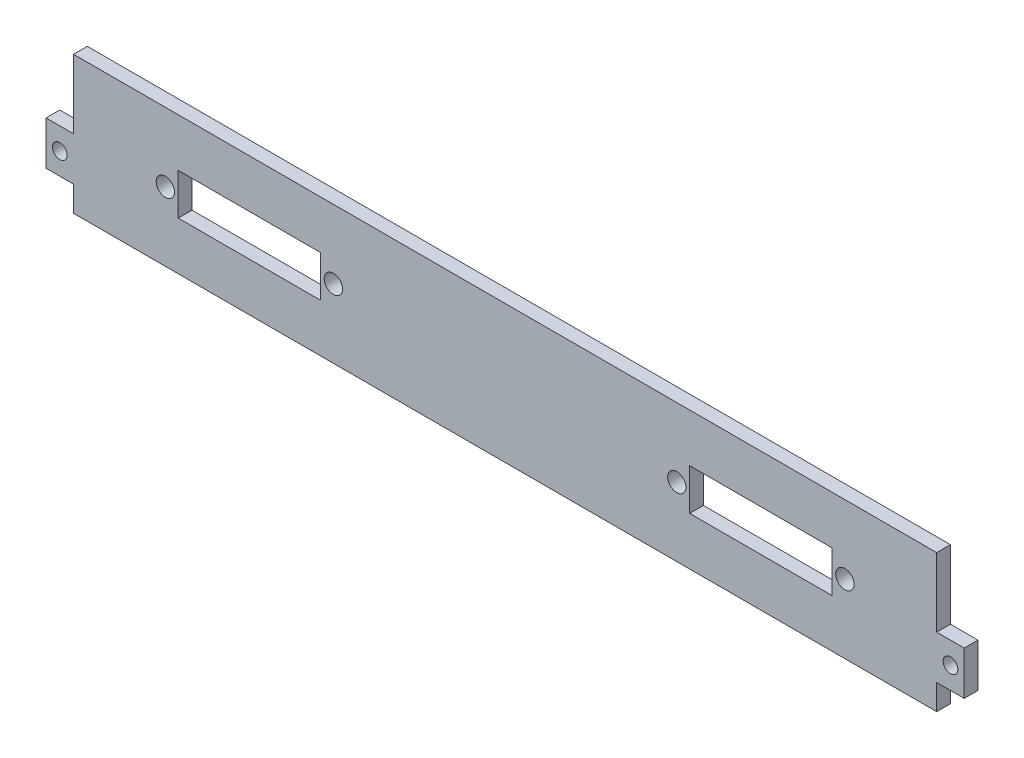
ISO-10303-21;
HEADER;
FILE_DESCRIPTION(('STEP AP214'),'2;1');
FILE_NAME('part.step','',(''),(''),'','','');
FILE_SCHEMA(('AUTOMOTIVE_DESIGN { 1 0 10303 214 1 1 1 1 }'));
ENDSEC;
DATA;
#1=APPLICATION_CONTEXT('core data for automotive mechanical design processes');
#2=APPLICATION_PROTOCOL_DEFINITION('international standard','automotive_design',2000,#1);
#3=PRODUCT_CONTEXT('',#1,'mechanical');
#4=PRODUCT('Part','Part','',(#3));
#5=PRODUCT_RELATED_PRODUCT_CATEGORY('part','',(#4));
#6=PRODUCT_DEFINITION_FORMATION('','',#4);
#7=PRODUCT_DEFINITION_CONTEXT('part definition',#1,'design');
#8=PRODUCT_DEFINITION('design','',#6,#7);
#9=PRODUCT_DEFINITION_SHAPE('','',#8);
#10=(LENGTH_UNIT() NAMED_UNIT(*) SI_UNIT(.MILLI.,.METRE.));
#11=(NAMED_UNIT(*) PLANE_ANGLE_UNIT() SI_UNIT($,.RADIAN.));
#12=(NAMED_UNIT(*) SI_UNIT($,.STERADIAN.) SOLID_ANGLE_UNIT());
#13=UNCERTAINTY_MEASURE_WITH_UNIT(LENGTH_MEASURE(1.E-05),#10,'distance_accuracy_value','');
#14=(GEOMETRIC_REPRESENTATION_CONTEXT(3) GLOBAL_UNCERTAINTY_ASSIGNED_CONTEXT((#13)) GLOBAL_UNIT_ASSIGNED_CONTEXT((#10,
#11,#12)) REPRESENTATION_CONTEXT('',''));
#15=CARTESIAN_POINT('',(0.,0.,0.));
#16=DIRECTION('',(0.,0.,1.));
#17=DIRECTION('',(1.,0.,0.));
#18=AXIS2_PLACEMENT_3D('',#15,#16,#17);
#19=CARTESIAN_POINT('',(0.,0.,3.));
#20=DIRECTION('',(0.,0.,1.));
#21=DIRECTION('',(1.,0.,0.));
#22=AXIS2_PLACEMENT_3D('',#19,#20,#21);
#23=PLANE('',#22);
#24=CARTESIAN_POINT('',(37.4,0.,3.));
#25=DIRECTION('',(0.,0.,1.));
#26=DIRECTION('',(-1.,0.,0.));
#27=AXIS2_PLACEMENT_3D('',#24,#25,#26);
#28=CIRCLE('',#27,2.);
#29=CARTESIAN_POINT('',(35.4,0.,3.));
#30=VERTEX_POINT('',#29);
#31=EDGE_CURVE('E245',#30,#30,#28,.T.);
#32=ORIENTED_EDGE('',*,*,#31,.F.);
#33=EDGE_LOOP('',(#32));
#34=FACE_BOUND('',#33,.T.);
#35=CARTESIAN_POINT('',(-74.,0.,3.));
#36=DIRECTION('',(0.,0.,1.));
#37=DIRECTION('',(1.,0.,0.));
#38=AXIS2_PLACEMENT_3D('',#35,#36,#37);
#39=CIRCLE('',#38,2.);
#40=CARTESIAN_POINT('',(-72.,0.,3.));
#41=VERTEX_POINT('',#40);
#42=EDGE_CURVE('E257',#41,#41,#39,.T.);
#43=ORIENTED_EDGE('',*,*,#42,.F.);
#44=EDGE_LOOP('',(#43));
#45=FACE_BOUND('',#44,.T.);
#46=CARTESIAN_POINT('',(-97.,-4.75000000000001,3.));
#47=DIRECTION('',(0.,0.,1.));
#48=DIRECTION('',(1.,0.,0.));
#49=AXIS2_PLACEMENT_3D('',#46,#47,#48);
#50=CIRCLE('',#49,1.60000000000001);
#51=CARTESIAN_POINT('',(-95.4,-4.75000000000001,3.));
#52=VERTEX_POINT('',#51);
#53=EDGE_CURVE('E269',#52,#52,#50,.T.);
#54=ORIENTED_EDGE('',*,*,#53,.F.);
#55=EDGE_LOOP('',(#54));
#56=FACE_BOUND('',#55,.T.);
#57=DIRECTION('',(0.,1.,0.));
#58=VECTOR('',#57,1.);
#59=CARTESIAN_POINT('',(94.,-9.49999999999999,3.));
#60=LINE('',#59,#58);
#61=CARTESIAN_POINT('',(94.,-15.,3.));
#62=VERTEX_POINT('',#61);
#63=CARTESIAN_POINT('',(94.,-9.49999999999999,3.));
#64=VERTEX_POINT('',#63);
#65=EDGE_CURVE('E275',#62,#64,#60,.T.);
#66=ORIENTED_EDGE('',*,*,#65,.T.);
#67=DIRECTION('',(1.,0.,0.));
#68=VECTOR('',#67,1.);
#69=CARTESIAN_POINT('',(94.,-9.49999999999999,3.));
#70=LINE('',#69,#68);
#71=CARTESIAN_POINT('',(100.,-9.49999999999998,3.));
#72=VERTEX_POINT('',#71);
#73=EDGE_CURVE('E278',#64,#72,#70,.T.);
#74=ORIENTED_EDGE('',*,*,#73,.T.);
#75=DIRECTION('',(0.,1.,0.));
#76=VECTOR('',#75,1.);
#77=CARTESIAN_POINT('',(100.,0.,3.));
#78=LINE('',#77,#76);
#79=CARTESIAN_POINT('',(100.,0.,3.));
#80=VERTEX_POINT('',#79);
#81=EDGE_CURVE('E281',#72,#80,#78,.T.);
#82=ORIENTED_EDGE('',*,*,#81,.T.);
#83=DIRECTION('',(-1.,0.,0.));
#84=VECTOR('',#83,1.);
#85=CARTESIAN_POINT('',(94.,0.,3.));
#86=LINE('',#85,#84);
#87=CARTESIAN_POINT('',(94.,0.,3.));
#88=VERTEX_POINT('',#87);
#89=EDGE_CURVE('E283',#80,#88,#86,.T.);
#90=ORIENTED_EDGE('',*,*,#89,.T.);
#91=DIRECTION('',(0.,1.,0.));
#92=VECTOR('',#91,1.);
#93=CARTESIAN_POINT('',(94.,15.,3.));
#94=LINE('',#93,#92);
#95=CARTESIAN_POINT('',(94.,15.,3.));
#96=VERTEX_POINT('',#95);
#97=EDGE_CURVE('E285',#88,#96,#94,.T.);
#98=ORIENTED_EDGE('',*,*,#97,.T.);
#99=DIRECTION('',(-1.,0.,0.));
#100=VECTOR('',#99,1.);
#101=CARTESIAN_POINT('',(-94.,15.,3.));
#102=LINE('',#101,#100);
#103=CARTESIAN_POINT('',(-94.,15.,3.));
#104=VERTEX_POINT('',#103);
#105=EDGE_CURVE('E287',#96,#104,#102,.T.);
#106=ORIENTED_EDGE('',*,*,#105,.T.);
#107=DIRECTION('',(0.,-1.,0.));
#108=VECTOR('',#107,1.);
#109=CARTESIAN_POINT('',(-94.,15.,3.));
#110=LINE('',#109,#108);
#111=CARTESIAN_POINT('',(-94.,0.,3.));
#112=VERTEX_POINT('',#111);
#113=EDGE_CURVE('E289',#104,#112,#110,.T.);
#114=ORIENTED_EDGE('',*,*,#113,.T.);
#115=DIRECTION('',(-1.,0.,0.));
#116=VECTOR('',#115,1.);
#117=CARTESIAN_POINT('',(-94.,0.,3.));
#118=LINE('',#117,#116);
#119=CARTESIAN_POINT('',(-100.,0.,3.));
#120=VERTEX_POINT('',#119);
#121=EDGE_CURVE('E291',#112,#120,#118,.T.);
#122=ORIENTED_EDGE('',*,*,#121,.T.);
#123=DIRECTION('',(0.,-1.,0.));
#124=VECTOR('',#123,1.);
#125=CARTESIAN_POINT('',(-100.,0.,3.));
#126=LINE('',#125,#124);
#127=CARTESIAN_POINT('',(-100.,-9.50000000000001,3.));
#128=VERTEX_POINT('',#127);
#129=EDGE_CURVE('E293',#120,#128,#126,.T.);
#130=ORIENTED_EDGE('',*,*,#129,.T.);
#131=DIRECTION('',(1.,0.,0.));
#132=VECTOR('',#131,1.);
#133=CARTESIAN_POINT('',(-94.,-9.50000000000001,3.));
#134=LINE('',#133,#132);
#135=CARTESIAN_POINT('',(-94.,-9.50000000000001,3.));
#136=VERTEX_POINT('',#135);
#137=EDGE_CURVE('E295',#128,#136,#134,.T.);
#138=ORIENTED_EDGE('',*,*,#137,.T.);
#139=DIRECTION('',(0.,-1.,0.));
#140=VECTOR('',#139,1.);
#141=CARTESIAN_POINT('',(-94.,-9.50000000000001,3.));
#142=LINE('',#141,#140);
#143=CARTESIAN_POINT('',(-94.,-15.,3.));
#144=VERTEX_POINT('',#143);
#145=EDGE_CURVE('E297',#136,#144,#142,.T.);
#146=ORIENTED_EDGE('',*,*,#145,.T.);
#147=DIRECTION('',(1.,0.,0.));
#148=VECTOR('',#147,1.);
#149=CARTESIAN_POINT('',(-94.,-15.,3.));
#150=LINE('',#149,#148);
#151=EDGE_CURVE('E299',#144,#62,#150,.T.);
#152=ORIENTED_EDGE('',*,*,#151,.T.);
#153=EDGE_LOOP('',(#66,#74,#82,#90,#98,#106,#114,#122,#130,#138,#146,#152));
#154=FACE_BOUND('',#153,.T.);
#155=CARTESIAN_POINT('',(97.,-4.74999999999999,3.));
#156=DIRECTION('',(0.,0.,1.));
#157=DIRECTION('',(-1.,0.,0.));
#158=AXIS2_PLACEMENT_3D('',#155,#156,#157);
#159=CIRCLE('',#158,1.60000000000001);
#160=CARTESIAN_POINT('',(95.4,-4.74999999999999,3.));
#161=VERTEX_POINT('',#160);
#162=EDGE_CURVE('E263',#161,#161,#159,.T.);
#163=ORIENTED_EDGE('',*,*,#162,.F.);
#164=EDGE_LOOP('',(#163));
#165=FACE_BOUND('',#164,.T.);
#166=CARTESIAN_POINT('',(-37.4,0.,3.));
#167=DIRECTION('',(0.,0.,1.));
#168=DIRECTION('',(1.,0.,0.));
#169=AXIS2_PLACEMENT_3D('',#166,#167,#168);
#170=CIRCLE('',#169,2.);
#171=CARTESIAN_POINT('',(-35.4,0.,3.));
#172=VERTEX_POINT('',#171);
#173=EDGE_CURVE('E251',#172,#172,#170,.T.);
#174=ORIENTED_EDGE('',*,*,#173,.F.);
#175=EDGE_LOOP('',(#174));
#176=FACE_BOUND('',#175,.T.);
#177=CARTESIAN_POINT('',(74.,0.,3.));
#178=DIRECTION('',(0.,0.,1.));
#179=DIRECTION('',(-1.,0.,0.));
#180=AXIS2_PLACEMENT_3D('',#177,#178,#179);
#181=CIRCLE('',#180,2.);
#182=CARTESIAN_POINT('',(72.,0.,3.));
#183=VERTEX_POINT('',#182);
#184=EDGE_CURVE('E239',#183,#183,#181,.T.);
#185=ORIENTED_EDGE('',*,*,#184,.F.);
#186=EDGE_LOOP('',(#185));
#187=FACE_BOUND('',#186,.T.);
#188=DIRECTION('',(-1.,0.,0.));
#189=VECTOR('',#188,1.);
#190=CARTESIAN_POINT('',(-71.2,4.49999999999999,3.));
#191=LINE('',#190,#189);
#192=CARTESIAN_POINT('',(-40.2,4.49999999999999,3.));
#193=VERTEX_POINT('',#192);
#194=CARTESIAN_POINT('',(-71.2,4.49999999999999,3.));
#195=VERTEX_POINT('',#194);
#196=EDGE_CURVE('E210',#193,#195,#191,.T.);
#197=ORIENTED_EDGE('',*,*,#196,.F.);
#198=DIRECTION('',(0.,1.,0.));
#199=VECTOR('',#198,1.);
#200=CARTESIAN_POINT('',(-40.2,4.49999999999999,3.));
#201=LINE('',#200,#199);
#202=CARTESIAN_POINT('',(-40.2,-4.50000000000001,3.));
#203=VERTEX_POINT('',#202);
#204=EDGE_CURVE('E208',#203,#193,#201,.T.);
#205=ORIENTED_EDGE('',*,*,#204,.F.);
#206=DIRECTION('',(1.,0.,0.));
#207=VECTOR('',#206,1.);
#208=CARTESIAN_POINT('',(-71.2,-4.50000000000001,3.));
#209=LINE('',#208,#207);
#210=CARTESIAN_POINT('',(-71.2,-4.50000000000001,3.));
#211=VERTEX_POINT('',#210);
#212=EDGE_CURVE('E216',#211,#203,#209,.T.);
#213=ORIENTED_EDGE('',*,*,#212,.F.);
#214=DIRECTION('',(0.,-1.,0.));
#215=VECTOR('',#214,1.);
#216=CARTESIAN_POINT('',(-71.2,4.49999999999999,3.));
#217=LINE('',#216,#215);
#218=EDGE_CURVE('E213',#195,#211,#217,.T.);
#219=ORIENTED_EDGE('',*,*,#218,.F.);
#220=EDGE_LOOP('',(#197,#205,#213,#219));
#221=FACE_BOUND('',#220,.T.);
#222=DIRECTION('',(-1.,0.,0.));
#223=VECTOR('',#222,1.);
#224=CARTESIAN_POINT('',(71.2,4.50000000000001,3.));
#225=LINE('',#224,#223);
#226=CARTESIAN_POINT('',(71.2,4.50000000000001,3.));
#227=VERTEX_POINT('',#226);
#228=CARTESIAN_POINT('',(40.2,4.5,3.));
#229=VERTEX_POINT('',#228);
#230=EDGE_CURVE('E180',#227,#229,#225,.T.);
#231=ORIENTED_EDGE('',*,*,#230,.F.);
#232=DIRECTION('',(0.,1.,0.));
#233=VECTOR('',#232,1.);
#234=CARTESIAN_POINT('',(71.2,4.50000000000001,3.));
#235=LINE('',#234,#233);
#236=CARTESIAN_POINT('',(71.2,-4.49999999999999,3.));
#237=VERTEX_POINT('',#236);
#238=EDGE_CURVE('E172',#237,#227,#235,.T.);
#239=ORIENTED_EDGE('',*,*,#238,.F.);
#240=DIRECTION('',(1.,0.,0.));
#241=VECTOR('',#240,1.);
#242=CARTESIAN_POINT('',(71.2,-4.49999999999999,3.));
#243=LINE('',#242,#241);
#244=CARTESIAN_POINT('',(40.2,-4.5,3.));
#245=VERTEX_POINT('',#244);
#246=EDGE_CURVE('E194',#245,#237,#243,.T.);
#247=ORIENTED_EDGE('',*,*,#246,.F.);
#248=DIRECTION('',(0.,-1.,0.));
#249=VECTOR('',#248,1.);
#250=CARTESIAN_POINT('',(40.2,4.5,3.));
#251=LINE('',#250,#249);
#252=EDGE_CURVE('E192',#229,#245,#251,.T.);
#253=ORIENTED_EDGE('',*,*,#252,.F.);
#254=EDGE_LOOP('',(#231,#239,#247,#253));
#255=FACE_BOUND('',#254,.T.);
#256=ADVANCED_FACE('F35',(#34,#45,#56,#154,#165,#176,#187,#221,#255),#23,.T.);
#257=CARTESIAN_POINT('',(0.,0.,0.));
#258=DIRECTION('',(0.,0.,1.));
#259=DIRECTION('',(1.,0.,0.));
#260=AXIS2_PLACEMENT_3D('',#257,#258,#259);
#261=PLANE('',#260);
#262=DIRECTION('',(0.,1.,0.));
#263=VECTOR('',#262,1.);
#264=CARTESIAN_POINT('',(-40.2,4.49999999999999,0.));
#265=LINE('',#264,#263);
#266=CARTESIAN_POINT('',(-40.2,-4.50000000000001,0.));
#267=VERTEX_POINT('',#266);
#268=CARTESIAN_POINT('',(-40.2,4.49999999999999,0.));
#269=VERTEX_POINT('',#268);
#270=EDGE_CURVE('E188',#267,#269,#265,.T.);
#271=ORIENTED_EDGE('',*,*,#270,.T.);
#272=DIRECTION('',(-1.,0.,0.));
#273=VECTOR('',#272,1.);
#274=CARTESIAN_POINT('',(-71.2,4.49999999999999,0.));
#275=LINE('',#274,#273);
#276=CARTESIAN_POINT('',(-71.2,4.49999999999999,0.));
#277=VERTEX_POINT('',#276);
#278=EDGE_CURVE('E221',#269,#277,#275,.T.);
#279=ORIENTED_EDGE('',*,*,#278,.T.);
#280=DIRECTION('',(0.,-1.,0.));
#281=VECTOR('',#280,1.);
#282=CARTESIAN_POINT('',(-71.2,4.49999999999999,0.));
#283=LINE('',#282,#281);
#284=CARTESIAN_POINT('',(-71.2,-4.50000000000001,0.));
#285=VERTEX_POINT('',#284);
#286=EDGE_CURVE('E224',#277,#285,#283,.T.);
#287=ORIENTED_EDGE('',*,*,#286,.T.);
#288=DIRECTION('',(1.,0.,0.));
#289=VECTOR('',#288,1.);
#290=CARTESIAN_POINT('',(-71.2,-4.50000000000001,0.));
#291=LINE('',#290,#289);
#292=EDGE_CURVE('E211',#285,#267,#291,.T.);
#293=ORIENTED_EDGE('',*,*,#292,.T.);
#294=EDGE_LOOP('',(#271,#279,#287,#293));
#295=FACE_BOUND('',#294,.T.);
#296=DIRECTION('',(0.,1.,0.));
#297=VECTOR('',#296,1.);
#298=CARTESIAN_POINT('',(94.,-9.49999999999999,0.));
#299=LINE('',#298,#297);
#300=CARTESIAN_POINT('',(94.,-15.,0.));
#301=VERTEX_POINT('',#300);
#302=CARTESIAN_POINT('',(94.,-9.49999999999999,0.));
#303=VERTEX_POINT('',#302);
#304=EDGE_CURVE('E272',#301,#303,#299,.T.);
#305=ORIENTED_EDGE('',*,*,#304,.F.);
#306=DIRECTION('',(1.,0.,0.));
#307=VECTOR('',#306,1.);
#308=CARTESIAN_POINT('',(-94.,-15.,0.));
#309=LINE('',#308,#307);
#310=CARTESIAN_POINT('',(-94.,-15.,0.));
#311=VERTEX_POINT('',#310);
#312=EDGE_CURVE('E279',#311,#301,#309,.T.);
#313=ORIENTED_EDGE('',*,*,#312,.F.);
#314=DIRECTION('',(0.,-1.,0.));
#315=VECTOR('',#314,1.);
#316=CARTESIAN_POINT('',(-94.,-9.50000000000001,0.));
#317=LINE('',#316,#315);
#318=CARTESIAN_POINT('',(-94.,-9.50000000000001,0.));
#319=VERTEX_POINT('',#318);
#320=EDGE_CURVE('E322',#319,#311,#317,.T.);
#321=ORIENTED_EDGE('',*,*,#320,.F.);
#322=DIRECTION('',(1.,0.,0.));
#323=VECTOR('',#322,1.);
#324=CARTESIAN_POINT('',(-94.,-9.50000000000001,0.));
#325=LINE('',#324,#323);
#326=CARTESIAN_POINT('',(-100.,-9.50000000000001,0.));
#327=VERTEX_POINT('',#326);
#328=EDGE_CURVE('E320',#327,#319,#325,.T.);
#329=ORIENTED_EDGE('',*,*,#328,.F.);
#330=DIRECTION('',(0.,-1.,0.));
#331=VECTOR('',#330,1.);
#332=CARTESIAN_POINT('',(-100.,0.,0.));
#333=LINE('',#332,#331);
#334=CARTESIAN_POINT('',(-100.,0.,0.));
#335=VERTEX_POINT('',#334);
#336=EDGE_CURVE('E318',#335,#327,#333,.T.);
#337=ORIENTED_EDGE('',*,*,#336,.F.);
#338=DIRECTION('',(-1.,0.,0.));
#339=VECTOR('',#338,1.);
#340=CARTESIAN_POINT('',(-94.,0.,0.));
#341=LINE('',#340,#339);
#342=CARTESIAN_POINT('',(-94.,0.,0.));
#343=VERTEX_POINT('',#342);
#344=EDGE_CURVE('E316',#343,#335,#341,.T.);
#345=ORIENTED_EDGE('',*,*,#344,.F.);
#346=DIRECTION('',(0.,-1.,0.));
#347=VECTOR('',#346,1.);
#348=CARTESIAN_POINT('',(-94.,15.,0.));
#349=LINE('',#348,#347);
#350=CARTESIAN_POINT('',(-94.,15.,0.));
#351=VERTEX_POINT('',#350);
#352=EDGE_CURVE('E314',#351,#343,#349,.T.);
#353=ORIENTED_EDGE('',*,*,#352,.F.);
#354=DIRECTION('',(-1.,0.,0.));
#355=VECTOR('',#354,1.);
#356=CARTESIAN_POINT('',(-94.,15.,0.));
#357=LINE('',#356,#355);
#358=CARTESIAN_POINT('',(94.,15.,0.));
#359=VERTEX_POINT('',#358);
#360=EDGE_CURVE('E312',#359,#351,#357,.T.);
#361=ORIENTED_EDGE('',*,*,#360,.F.);
#362=DIRECTION('',(0.,1.,0.));
#363=VECTOR('',#362,1.);
#364=CARTESIAN_POINT('',(94.,15.,0.));
#365=LINE('',#364,#363);
#366=CARTESIAN_POINT('',(94.,0.,0.));
#367=VERTEX_POINT('',#366);
#368=EDGE_CURVE('E310',#367,#359,#365,.T.);
#369=ORIENTED_EDGE('',*,*,#368,.F.);
#370=DIRECTION('',(-1.,0.,0.));
#371=VECTOR('',#370,1.);
#372=CARTESIAN_POINT('',(94.,0.,0.));
#373=LINE('',#372,#371);
#374=CARTESIAN_POINT('',(100.,0.,0.));
#375=VERTEX_POINT('',#374);
#376=EDGE_CURVE('E308',#375,#367,#373,.T.);
#377=ORIENTED_EDGE('',*,*,#376,.F.);
#378=DIRECTION('',(0.,1.,0.));
#379=VECTOR('',#378,1.);
#380=CARTESIAN_POINT('',(100.,0.,0.));
#381=LINE('',#380,#379);
#382=CARTESIAN_POINT('',(100.,-9.49999999999998,0.));
#383=VERTEX_POINT('',#382);
#384=EDGE_CURVE('E306',#383,#375,#381,.T.);
#385=ORIENTED_EDGE('',*,*,#384,.F.);
#386=DIRECTION('',(1.,0.,0.));
#387=VECTOR('',#386,1.);
#388=CARTESIAN_POINT('',(94.,-9.49999999999999,0.));
#389=LINE('',#388,#387);
#390=EDGE_CURVE('E304',#303,#383,#389,.T.);
#391=ORIENTED_EDGE('',*,*,#390,.F.);
#392=EDGE_LOOP('',(#305,#313,#321,#329,#337,#345,#353,#361,#369,#377,#385,#391));
#393=FACE_BOUND('',#392,.T.);
#394=CARTESIAN_POINT('',(-97.,-4.75000000000001,0.));
#395=DIRECTION('',(0.,0.,1.));
#396=DIRECTION('',(1.,0.,0.));
#397=AXIS2_PLACEMENT_3D('',#394,#395,#396);
#398=CIRCLE('',#397,1.60000000000001);
#399=CARTESIAN_POINT('',(-95.4,-4.75000000000001,0.));
#400=VERTEX_POINT('',#399);
#401=EDGE_CURVE('E266',#400,#400,#398,.T.);
#402=ORIENTED_EDGE('',*,*,#401,.T.);
#403=EDGE_LOOP('',(#402));
#404=FACE_BOUND('',#403,.T.);
#405=CARTESIAN_POINT('',(97.,-4.74999999999999,0.));
#406=DIRECTION('',(0.,0.,1.));
#407=DIRECTION('',(-1.,0.,0.));
#408=AXIS2_PLACEMENT_3D('',#405,#406,#407);
#409=CIRCLE('',#408,1.60000000000001);
#410=CARTESIAN_POINT('',(95.4,-4.74999999999999,0.));
#411=VERTEX_POINT('',#410);
#412=EDGE_CURVE('E260',#411,#411,#409,.T.);
#413=ORIENTED_EDGE('',*,*,#412,.T.);
#414=EDGE_LOOP('',(#413));
#415=FACE_BOUND('',#414,.T.);
#416=CARTESIAN_POINT('',(-74.,0.,0.));
#417=DIRECTION('',(0.,0.,1.));
#418=DIRECTION('',(1.,0.,0.));
#419=AXIS2_PLACEMENT_3D('',#416,#417,#418);
#420=CIRCLE('',#419,2.);
#421=CARTESIAN_POINT('',(-72.,0.,0.));
#422=VERTEX_POINT('',#421);
#423=EDGE_CURVE('E254',#422,#422,#420,.T.);
#424=ORIENTED_EDGE('',*,*,#423,.T.);
#425=EDGE_LOOP('',(#424));
#426=FACE_BOUND('',#425,.T.);
#427=CARTESIAN_POINT('',(-37.4,0.,0.));
#428=DIRECTION('',(0.,0.,1.));
#429=DIRECTION('',(1.,0.,0.));
#430=AXIS2_PLACEMENT_3D('',#427,#428,#429);
#431=CIRCLE('',#430,2.);
#432=CARTESIAN_POINT('',(-35.4,0.,0.));
#433=VERTEX_POINT('',#432);
#434=EDGE_CURVE('E248',#433,#433,#431,.T.);
#435=ORIENTED_EDGE('',*,*,#434,.T.);
#436=EDGE_LOOP('',(#435));
#437=FACE_BOUND('',#436,.T.);
#438=CARTESIAN_POINT('',(37.4,0.,0.));
#439=DIRECTION('',(0.,0.,1.));
#440=DIRECTION('',(-1.,0.,0.));
#441=AXIS2_PLACEMENT_3D('',#438,#439,#440);
#442=CIRCLE('',#441,2.);
#443=CARTESIAN_POINT('',(35.4,0.,0.));
#444=VERTEX_POINT('',#443);
#445=EDGE_CURVE('E242',#444,#444,#442,.T.);
#446=ORIENTED_EDGE('',*,*,#445,.T.);
#447=EDGE_LOOP('',(#446));
#448=FACE_BOUND('',#447,.T.);
#449=CARTESIAN_POINT('',(74.,0.,0.));
#450=DIRECTION('',(0.,0.,1.));
#451=DIRECTION('',(-1.,0.,0.));
#452=AXIS2_PLACEMENT_3D('',#449,#450,#451);
#453=CIRCLE('',#452,2.);
#454=CARTESIAN_POINT('',(72.,0.,0.));
#455=VERTEX_POINT('',#454);
#456=EDGE_CURVE('E238',#455,#455,#453,.T.);
#457=ORIENTED_EDGE('',*,*,#456,.T.);
#458=EDGE_LOOP('',(#457));
#459=FACE_BOUND('',#458,.T.);
#460=DIRECTION('',(0.,1.,0.));
#461=VECTOR('',#460,1.);
#462=CARTESIAN_POINT('',(71.2,4.50000000000001,0.));
#463=LINE('',#462,#461);
#464=CARTESIAN_POINT('',(71.2,-4.49999999999999,0.));
#465=VERTEX_POINT('',#464);
#466=CARTESIAN_POINT('',(71.2,4.50000000000001,0.));
#467=VERTEX_POINT('',#466);
#468=EDGE_CURVE('E58',#465,#467,#463,.T.);
#469=ORIENTED_EDGE('',*,*,#468,.T.);
#470=DIRECTION('',(-1.,0.,0.));
#471=VECTOR('',#470,1.);
#472=CARTESIAN_POINT('',(71.2,4.50000000000001,0.));
#473=LINE('',#472,#471);
#474=CARTESIAN_POINT('',(40.2,4.5,0.));
#475=VERTEX_POINT('',#474);
#476=EDGE_CURVE('E187',#467,#475,#473,.T.);
#477=ORIENTED_EDGE('',*,*,#476,.T.);
#478=DIRECTION('',(0.,-1.,0.));
#479=VECTOR('',#478,1.);
#480=CARTESIAN_POINT('',(40.2,4.5,0.));
#481=LINE('',#480,#479);
#482=CARTESIAN_POINT('',(40.2,-4.5,0.));
#483=VERTEX_POINT('',#482);
#484=EDGE_CURVE('E200',#475,#483,#481,.T.);
#485=ORIENTED_EDGE('',*,*,#484,.T.);
#486=DIRECTION('',(1.,0.,0.));
#487=VECTOR('',#486,1.);
#488=CARTESIAN_POINT('',(71.2,-4.49999999999999,0.));
#489=LINE('',#488,#487);
#490=EDGE_CURVE('E181',#483,#465,#489,.T.);
#491=ORIENTED_EDGE('',*,*,#490,.T.);
#492=EDGE_LOOP('',(#469,#477,#485,#491));
#493=FACE_BOUND('',#492,.T.);
#494=ADVANCED_FACE('F364',(#295,#393,#404,#415,#426,#437,#448,#459,#493),#261,.F.);
#495=CARTESIAN_POINT('',(94.,-9.49999999999999,3.));
#496=DIRECTION('',(-1.,0.,0.));
#497=DIRECTION('',(0.,0.,1.));
#498=AXIS2_PLACEMENT_3D('',#495,#496,#497);
#499=PLANE('',#498);
#500=ORIENTED_EDGE('',*,*,#304,.T.);
#501=DIRECTION('',(0.,0.,-1.));
#502=VECTOR('',#501,1.);
#503=CARTESIAN_POINT('',(94.,-9.49999999999999,3.));
#504=LINE('',#503,#502);
#505=EDGE_CURVE('E11',#64,#303,#504,.T.);
#506=ORIENTED_EDGE('',*,*,#505,.F.);
#507=ORIENTED_EDGE('',*,*,#65,.F.);
#508=DIRECTION('',(0.,0.,-1.));
#509=VECTOR('',#508,1.);
#510=CARTESIAN_POINT('',(94.,-15.,3.));
#511=LINE('',#510,#509);
#512=EDGE_CURVE('E301',#62,#301,#511,.T.);
#513=ORIENTED_EDGE('',*,*,#512,.T.);
#514=EDGE_LOOP('',(#500,#506,#507,#513));
#515=FACE_BOUND('',#514,.T.);
#516=ADVANCED_FACE('F37',(#515),#499,.F.);
#517=CARTESIAN_POINT('',(94.,-9.49999999999999,3.));
#518=DIRECTION('',(0.,1.,0.));
#519=DIRECTION('',(-1.,0.,0.));
#520=AXIS2_PLACEMENT_3D('',#517,#518,#519);
#521=PLANE('',#520);
#522=ORIENTED_EDGE('',*,*,#390,.T.);
#523=DIRECTION('',(0.,0.,-1.));
#524=VECTOR('',#523,1.);
#525=CARTESIAN_POINT('',(100.,-9.49999999999998,3.));
#526=LINE('',#525,#524);
#527=EDGE_CURVE('E43',#72,#383,#526,.T.);
#528=ORIENTED_EDGE('',*,*,#527,.F.);
#529=ORIENTED_EDGE('',*,*,#73,.F.);
#530=ORIENTED_EDGE('',*,*,#505,.T.);
#531=EDGE_LOOP('',(#522,#528,#529,#530));
#532=FACE_BOUND('',#531,.T.);
#533=ADVANCED_FACE('F382',(#532),#521,.F.);
#534=CARTESIAN_POINT('',(100.,0.,3.));
#535=DIRECTION('',(-1.,0.,0.));
#536=DIRECTION('',(0.,0.,1.));
#537=AXIS2_PLACEMENT_3D('',#534,#535,#536);
#538=PLANE('',#537);
#539=ORIENTED_EDGE('',*,*,#384,.T.);
#540=DIRECTION('',(0.,0.,-1.));
#541=VECTOR('',#540,1.);
#542=CARTESIAN_POINT('',(100.,0.,3.));
#543=LINE('',#542,#541);
#544=EDGE_CURVE('E351',#80,#375,#543,.T.);
#545=ORIENTED_EDGE('',*,*,#544,.F.);
#546=ORIENTED_EDGE('',*,*,#81,.F.);
#547=ORIENTED_EDGE('',*,*,#527,.T.);
#548=EDGE_LOOP('',(#539,#545,#546,#547));
#549=FACE_BOUND('',#548,.T.);
#550=ADVANCED_FACE('F358',(#549),#538,.F.);
#551=CARTESIAN_POINT('',(94.,0.,3.));
#552=DIRECTION('',(0.,-1.,0.));
#553=DIRECTION('',(1.,0.,0.));
#554=AXIS2_PLACEMENT_3D('',#551,#552,#553);
#555=PLANE('',#554);
#556=ORIENTED_EDGE('',*,*,#376,.T.);
#557=DIRECTION('',(0.,0.,-1.));
#558=VECTOR('',#557,1.);
#559=CARTESIAN_POINT('',(94.,0.,3.));
#560=LINE('',#559,#558);
#561=EDGE_CURVE('E348',#88,#367,#560,.T.);
#562=ORIENTED_EDGE('',*,*,#561,.F.);
#563=ORIENTED_EDGE('',*,*,#89,.F.);
#564=ORIENTED_EDGE('',*,*,#544,.T.);
#565=EDGE_LOOP('',(#556,#562,#563,#564));
#566=FACE_BOUND('',#565,.T.);
#567=ADVANCED_FACE('F370',(#566),#555,.F.);
#568=CARTESIAN_POINT('',(94.,15.,3.));
#569=DIRECTION('',(-1.,0.,0.));
#570=DIRECTION('',(0.,0.,1.));
#571=AXIS2_PLACEMENT_3D('',#568,#569,#570);
#572=PLANE('',#571);
#573=ORIENTED_EDGE('',*,*,#368,.T.);
#574=DIRECTION('',(0.,0.,-1.));
#575=VECTOR('',#574,1.);
#576=CARTESIAN_POINT('',(94.,15.,3.));
#577=LINE('',#576,#575);
#578=EDGE_CURVE('E345',#96,#359,#577,.T.);
#579=ORIENTED_EDGE('',*,*,#578,.F.);
#580=ORIENTED_EDGE('',*,*,#97,.F.);
#581=ORIENTED_EDGE('',*,*,#561,.T.);
#582=EDGE_LOOP('',(#573,#579,#580,#581));
#583=FACE_BOUND('',#582,.T.);
#584=ADVANCED_FACE('F374',(#583),#572,.F.);
#585=CARTESIAN_POINT('',(-94.,15.,3.));
#586=DIRECTION('',(0.,-1.,0.));
#587=DIRECTION('',(1.,0.,0.));
#588=AXIS2_PLACEMENT_3D('',#585,#586,#587);
#589=PLANE('',#588);
#590=ORIENTED_EDGE('',*,*,#360,.T.);
#591=DIRECTION('',(0.,0.,-1.));
#592=VECTOR('',#591,1.);
#593=CARTESIAN_POINT('',(-94.,15.,3.));
#594=LINE('',#593,#592);
#595=EDGE_CURVE('E342',#104,#351,#594,.T.);
#596=ORIENTED_EDGE('',*,*,#595,.F.);
#597=ORIENTED_EDGE('',*,*,#105,.F.);
#598=ORIENTED_EDGE('',*,*,#578,.T.);
#599=EDGE_LOOP('',(#590,#596,#597,#598));
#600=FACE_BOUND('',#599,.T.);
#601=ADVANCED_FACE('F415',(#600),#589,.F.);
#602=CARTESIAN_POINT('',(-94.,15.,3.));
#603=DIRECTION('',(1.,0.,0.));
#604=DIRECTION('',(0.,0.,-1.));
#605=AXIS2_PLACEMENT_3D('',#602,#603,#604);
#606=PLANE('',#605);
#607=ORIENTED_EDGE('',*,*,#352,.T.);
#608=DIRECTION('',(0.,0.,-1.));
#609=VECTOR('',#608,1.);
#610=CARTESIAN_POINT('',(-94.,0.,3.));
#611=LINE('',#610,#609);
#612=EDGE_CURVE('E339',#112,#343,#611,.T.);
#613=ORIENTED_EDGE('',*,*,#612,.F.);
#614=ORIENTED_EDGE('',*,*,#113,.F.);
#615=ORIENTED_EDGE('',*,*,#595,.T.);
#616=EDGE_LOOP('',(#607,#613,#614,#615));
#617=FACE_BOUND('',#616,.T.);
#618=ADVANCED_FACE('F413',(#617),#606,.F.);
#619=CARTESIAN_POINT('',(-94.,0.,3.));
#620=DIRECTION('',(0.,-1.,0.));
#621=DIRECTION('',(0.,0.,-1.));
#622=AXIS2_PLACEMENT_3D('',#619,#620,#621);
#623=PLANE('',#622);
#624=ORIENTED_EDGE('',*,*,#344,.T.);
#625=DIRECTION('',(0.,0.,-1.));
#626=VECTOR('',#625,1.);
#627=CARTESIAN_POINT('',(-100.,0.,3.));
#628=LINE('',#627,#626);
#629=EDGE_CURVE('E336',#120,#335,#628,.T.);
#630=ORIENTED_EDGE('',*,*,#629,.F.);
#631=ORIENTED_EDGE('',*,*,#121,.F.);
#632=ORIENTED_EDGE('',*,*,#612,.T.);
#633=EDGE_LOOP('',(#624,#630,#631,#632));
#634=FACE_BOUND('',#633,.T.);
#635=ADVANCED_FACE('F409',(#634),#623,.F.);
#636=CARTESIAN_POINT('',(-100.,0.,3.));
#637=DIRECTION('',(1.,0.,0.));
#638=DIRECTION('',(0.,0.,-1.));
#639=AXIS2_PLACEMENT_3D('',#636,#637,#638);
#640=PLANE('',#639);
#641=ORIENTED_EDGE('',*,*,#336,.T.);
#642=DIRECTION('',(0.,0.,-1.));
#643=VECTOR('',#642,1.);
#644=CARTESIAN_POINT('',(-100.,-9.50000000000001,3.));
#645=LINE('',#644,#643);
#646=EDGE_CURVE('E333',#128,#327,#645,.T.);
#647=ORIENTED_EDGE('',*,*,#646,.F.);
#648=ORIENTED_EDGE('',*,*,#129,.F.);
#649=ORIENTED_EDGE('',*,*,#629,.T.);
#650=EDGE_LOOP('',(#641,#647,#648,#649));
#651=FACE_BOUND('',#650,.T.);
#652=ADVANCED_FACE('F404',(#651),#640,.F.);
#653=CARTESIAN_POINT('',(-94.,-9.50000000000001,3.));
#654=DIRECTION('',(0.,1.,0.));
#655=DIRECTION('',(0.,0.,1.));
#656=AXIS2_PLACEMENT_3D('',#653,#654,#655);
#657=PLANE('',#656);
#658=ORIENTED_EDGE('',*,*,#328,.T.);
#659=DIRECTION('',(0.,0.,-1.));
#660=VECTOR('',#659,1.);
#661=CARTESIAN_POINT('',(-94.,-9.50000000000001,3.));
#662=LINE('',#661,#660);
#663=EDGE_CURVE('E330',#136,#319,#662,.T.);
#664=ORIENTED_EDGE('',*,*,#663,.F.);
#665=ORIENTED_EDGE('',*,*,#137,.F.);
#666=ORIENTED_EDGE('',*,*,#646,.T.);
#667=EDGE_LOOP('',(#658,#664,#665,#666));
#668=FACE_BOUND('',#667,.T.);
#669=ADVANCED_FACE('F398',(#668),#657,.F.);
#670=CARTESIAN_POINT('',(-94.,-9.50000000000001,3.));
#671=DIRECTION('',(1.,0.,0.));
#672=DIRECTION('',(0.,0.,-1.));
#673=AXIS2_PLACEMENT_3D('',#670,#671,#672);
#674=PLANE('',#673);
#675=ORIENTED_EDGE('',*,*,#320,.T.);
#676=DIRECTION('',(0.,0.,-1.));
#677=VECTOR('',#676,1.);
#678=CARTESIAN_POINT('',(-94.,-15.,3.));
#679=LINE('',#678,#677);
#680=EDGE_CURVE('E327',#144,#311,#679,.T.);
#681=ORIENTED_EDGE('',*,*,#680,.F.);
#682=ORIENTED_EDGE('',*,*,#145,.F.);
#683=ORIENTED_EDGE('',*,*,#663,.T.);
#684=EDGE_LOOP('',(#675,#681,#682,#683));
#685=FACE_BOUND('',#684,.T.);
#686=ADVANCED_FACE('F394',(#685),#674,.F.);
#687=CARTESIAN_POINT('',(-94.,-15.,3.));
#688=DIRECTION('',(0.,1.,0.));
#689=DIRECTION('',(-1.,0.,0.));
#690=AXIS2_PLACEMENT_3D('',#687,#688,#689);
#691=PLANE('',#690);
#692=ORIENTED_EDGE('',*,*,#312,.T.);
#693=ORIENTED_EDGE('',*,*,#512,.F.);
#694=ORIENTED_EDGE('',*,*,#151,.F.);
#695=ORIENTED_EDGE('',*,*,#680,.T.);
#696=EDGE_LOOP('',(#692,#693,#694,#695));
#697=FACE_BOUND('',#696,.T.);
#698=ADVANCED_FACE('F389',(#697),#691,.F.);
#699=CARTESIAN_POINT('',(-97.,-4.75000000000001,3.));
#700=DIRECTION('',(0.,0.,-1.));
#701=DIRECTION('',(-1.,0.,0.));
#702=AXIS2_PLACEMENT_3D('',#699,#700,#701);
#703=CYLINDRICAL_SURFACE('',#702,1.60000000000001);
#704=ORIENTED_EDGE('',*,*,#53,.T.);
#705=EDGE_LOOP('',(#704));
#706=FACE_BOUND('',#705,.T.);
#707=ORIENTED_EDGE('',*,*,#401,.F.);
#708=EDGE_LOOP('',(#707));
#709=FACE_BOUND('',#708,.T.);
#710=ADVANCED_FACE('F435',(#706,#709),#703,.F.);
#711=CARTESIAN_POINT('',(97.,-4.74999999999999,3.));
#712=DIRECTION('',(0.,0.,-1.));
#713=DIRECTION('',(-1.,0.,0.));
#714=AXIS2_PLACEMENT_3D('',#711,#712,#713);
#715=CYLINDRICAL_SURFACE('',#714,1.60000000000001);
#716=ORIENTED_EDGE('',*,*,#162,.T.);
#717=EDGE_LOOP('',(#716));
#718=FACE_BOUND('',#717,.T.);
#719=ORIENTED_EDGE('',*,*,#412,.F.);
#720=EDGE_LOOP('',(#719));
#721=FACE_BOUND('',#720,.T.);
#722=ADVANCED_FACE('F473',(#718,#721),#715,.F.);
#723=CARTESIAN_POINT('',(-74.,0.,3.));
#724=DIRECTION('',(0.,0.,-1.));
#725=DIRECTION('',(-1.,0.,0.));
#726=AXIS2_PLACEMENT_3D('',#723,#724,#725);
#727=CYLINDRICAL_SURFACE('',#726,2.);
#728=ORIENTED_EDGE('',*,*,#42,.T.);
#729=EDGE_LOOP('',(#728));
#730=FACE_BOUND('',#729,.T.);
#731=ORIENTED_EDGE('',*,*,#423,.F.);
#732=EDGE_LOOP('',(#731));
#733=FACE_BOUND('',#732,.T.);
#734=ADVANCED_FACE('F480',(#730,#733),#727,.F.);
#735=CARTESIAN_POINT('',(-37.4,0.,3.));
#736=DIRECTION('',(0.,0.,-1.));
#737=DIRECTION('',(-1.,0.,0.));
#738=AXIS2_PLACEMENT_3D('',#735,#736,#737);
#739=CYLINDRICAL_SURFACE('',#738,2.);
#740=ORIENTED_EDGE('',*,*,#173,.T.);
#741=EDGE_LOOP('',(#740));
#742=FACE_BOUND('',#741,.T.);
#743=ORIENTED_EDGE('',*,*,#434,.F.);
#744=EDGE_LOOP('',(#743));
#745=FACE_BOUND('',#744,.T.);
#746=ADVANCED_FACE('F487',(#742,#745),#739,.F.);
#747=CARTESIAN_POINT('',(37.4,0.,3.));
#748=DIRECTION('',(0.,0.,-1.));
#749=DIRECTION('',(-1.,0.,0.));
#750=AXIS2_PLACEMENT_3D('',#747,#748,#749);
#751=CYLINDRICAL_SURFACE('',#750,2.);
#752=ORIENTED_EDGE('',*,*,#31,.T.);
#753=EDGE_LOOP('',(#752));
#754=FACE_BOUND('',#753,.T.);
#755=ORIENTED_EDGE('',*,*,#445,.F.);
#756=EDGE_LOOP('',(#755));
#757=FACE_BOUND('',#756,.T.);
#758=ADVANCED_FACE('F495',(#754,#757),#751,.F.);
#759=CARTESIAN_POINT('',(74.,0.,3.));
#760=DIRECTION('',(0.,0.,-1.));
#761=DIRECTION('',(-1.,0.,0.));
#762=AXIS2_PLACEMENT_3D('',#759,#760,#761);
#763=CYLINDRICAL_SURFACE('',#762,2.);
#764=ORIENTED_EDGE('',*,*,#184,.T.);
#765=EDGE_LOOP('',(#764));
#766=FACE_BOUND('',#765,.T.);
#767=ORIENTED_EDGE('',*,*,#456,.F.);
#768=EDGE_LOOP('',(#767));
#769=FACE_BOUND('',#768,.T.);
#770=ADVANCED_FACE('F503',(#766,#769),#763,.F.);
#771=CARTESIAN_POINT('',(-40.2,4.49999999999999,3.));
#772=DIRECTION('',(-1.,0.,0.));
#773=DIRECTION('',(0.,0.,1.));
#774=AXIS2_PLACEMENT_3D('',#771,#772,#773);
#775=PLANE('',#774);
#776=ORIENTED_EDGE('',*,*,#270,.F.);
#777=DIRECTION('',(0.,0.,-1.));
#778=VECTOR('',#777,1.);
#779=CARTESIAN_POINT('',(-40.2,-4.50000000000001,3.));
#780=LINE('',#779,#778);
#781=EDGE_CURVE('E218',#203,#267,#780,.T.);
#782=ORIENTED_EDGE('',*,*,#781,.F.);
#783=ORIENTED_EDGE('',*,*,#204,.T.);
#784=DIRECTION('',(0.,0.,-1.));
#785=VECTOR('',#784,1.);
#786=CARTESIAN_POINT('',(-40.2,4.49999999999999,3.));
#787=LINE('',#786,#785);
#788=EDGE_CURVE('E235',#193,#269,#787,.T.);
#789=ORIENTED_EDGE('',*,*,#788,.T.);
#790=EDGE_LOOP('',(#776,#782,#783,#789));
#791=FACE_BOUND('',#790,.T.);
#792=ADVANCED_FACE('F511',(#791),#775,.T.);
#793=CARTESIAN_POINT('',(-71.2,4.49999999999999,3.));
#794=DIRECTION('',(0.,-1.,0.));
#795=DIRECTION('',(0.,0.,-1.));
#796=AXIS2_PLACEMENT_3D('',#793,#794,#795);
#797=PLANE('',#796);
#798=ORIENTED_EDGE('',*,*,#278,.F.);
#799=ORIENTED_EDGE('',*,*,#788,.F.);
#800=ORIENTED_EDGE('',*,*,#196,.T.);
#801=DIRECTION('',(0.,0.,-1.));
#802=VECTOR('',#801,1.);
#803=CARTESIAN_POINT('',(-71.2,4.49999999999999,3.));
#804=LINE('',#803,#802);
#805=EDGE_CURVE('E233',#195,#277,#804,.T.);
#806=ORIENTED_EDGE('',*,*,#805,.T.);
#807=EDGE_LOOP('',(#798,#799,#800,#806));
#808=FACE_BOUND('',#807,.T.);
#809=ADVANCED_FACE('F519',(#808),#797,.T.);
#810=CARTESIAN_POINT('',(-71.2,4.49999999999999,3.));
#811=DIRECTION('',(1.,0.,0.));
#812=DIRECTION('',(0.,0.,-1.));
#813=AXIS2_PLACEMENT_3D('',#810,#811,#812);
#814=PLANE('',#813);
#815=ORIENTED_EDGE('',*,*,#286,.F.);
#816=ORIENTED_EDGE('',*,*,#805,.F.);
#817=ORIENTED_EDGE('',*,*,#218,.T.);
#818=DIRECTION('',(0.,0.,-1.));
#819=VECTOR('',#818,1.);
#820=CARTESIAN_POINT('',(-71.2,-4.50000000000001,3.));
#821=LINE('',#820,#819);
#822=EDGE_CURVE('E231',#211,#285,#821,.T.);
#823=ORIENTED_EDGE('',*,*,#822,.T.);
#824=EDGE_LOOP('',(#815,#816,#817,#823));
#825=FACE_BOUND('',#824,.T.);
#826=ADVANCED_FACE('F527',(#825),#814,.T.);
#827=CARTESIAN_POINT('',(-71.2,-4.50000000000001,3.));
#828=DIRECTION('',(0.,1.,0.));
#829=DIRECTION('',(0.,0.,1.));
#830=AXIS2_PLACEMENT_3D('',#827,#828,#829);
#831=PLANE('',#830);
#832=ORIENTED_EDGE('',*,*,#292,.F.);
#833=ORIENTED_EDGE('',*,*,#822,.F.);
#834=ORIENTED_EDGE('',*,*,#212,.T.);
#835=ORIENTED_EDGE('',*,*,#781,.T.);
#836=EDGE_LOOP('',(#832,#833,#834,#835));
#837=FACE_BOUND('',#836,.T.);
#838=ADVANCED_FACE('F535',(#837),#831,.T.);
#839=CARTESIAN_POINT('',(71.2,4.50000000000001,3.));
#840=DIRECTION('',(-1.,0.,0.));
#841=DIRECTION('',(0.,0.,1.));
#842=AXIS2_PLACEMENT_3D('',#839,#840,#841);
#843=PLANE('',#842);
#844=ORIENTED_EDGE('',*,*,#468,.F.);
#845=DIRECTION('',(0.,0.,-1.));
#846=VECTOR('',#845,1.);
#847=CARTESIAN_POINT('',(71.2,-4.49999999999999,3.));
#848=LINE('',#847,#846);
#849=EDGE_CURVE('E176',#237,#465,#848,.T.);
#850=ORIENTED_EDGE('',*,*,#849,.F.);
#851=ORIENTED_EDGE('',*,*,#238,.T.);
#852=DIRECTION('',(0.,0.,-1.));
#853=VECTOR('',#852,1.);
#854=CARTESIAN_POINT('',(71.2,4.50000000000001,3.));
#855=LINE('',#854,#853);
#856=EDGE_CURVE('E175',#227,#467,#855,.T.);
#857=ORIENTED_EDGE('',*,*,#856,.T.);
#858=EDGE_LOOP('',(#844,#850,#851,#857));
#859=FACE_BOUND('',#858,.T.);
#860=ADVANCED_FACE('F174',(#859),#843,.T.);
#861=CARTESIAN_POINT('',(71.2,4.50000000000001,3.));
#862=DIRECTION('',(0.,-1.,0.));
#863=DIRECTION('',(1.,0.,0.));
#864=AXIS2_PLACEMENT_3D('',#861,#862,#863);
#865=PLANE('',#864);
#866=ORIENTED_EDGE('',*,*,#476,.F.);
#867=ORIENTED_EDGE('',*,*,#856,.F.);
#868=ORIENTED_EDGE('',*,*,#230,.T.);
#869=DIRECTION('',(0.,0.,-1.));
#870=VECTOR('',#869,1.);
#871=CARTESIAN_POINT('',(40.2,4.5,3.));
#872=LINE('',#871,#870);
#873=EDGE_CURVE('E189',#229,#475,#872,.T.);
#874=ORIENTED_EDGE('',*,*,#873,.T.);
#875=EDGE_LOOP('',(#866,#867,#868,#874));
#876=FACE_BOUND('',#875,.T.);
#877=ADVANCED_FACE('F184',(#876),#865,.T.);
#878=CARTESIAN_POINT('',(40.2,4.5,3.));
#879=DIRECTION('',(1.,0.,0.));
#880=DIRECTION('',(0.,0.,-1.));
#881=AXIS2_PLACEMENT_3D('',#878,#879,#880);
#882=PLANE('',#881);
#883=ORIENTED_EDGE('',*,*,#484,.F.);
#884=ORIENTED_EDGE('',*,*,#873,.F.);
#885=ORIENTED_EDGE('',*,*,#252,.T.);
#886=DIRECTION('',(0.,0.,-1.));
#887=VECTOR('',#886,1.);
#888=CARTESIAN_POINT('',(40.2,-4.5,3.));
#889=LINE('',#888,#887);
#890=EDGE_CURVE('E50',#245,#483,#889,.T.);
#891=ORIENTED_EDGE('',*,*,#890,.T.);
#892=EDGE_LOOP('',(#883,#884,#885,#891));
#893=FACE_BOUND('',#892,.T.);
#894=ADVANCED_FACE('F556',(#893),#882,.T.);
#895=CARTESIAN_POINT('',(71.2,-4.49999999999999,3.));
#896=DIRECTION('',(0.,1.,0.));
#897=DIRECTION('',(-1.,0.,0.));
#898=AXIS2_PLACEMENT_3D('',#895,#896,#897);
#899=PLANE('',#898);
#900=ORIENTED_EDGE('',*,*,#490,.F.);
#901=ORIENTED_EDGE('',*,*,#890,.F.);
#902=ORIENTED_EDGE('',*,*,#246,.T.);
#903=ORIENTED_EDGE('',*,*,#849,.T.);
#904=EDGE_LOOP('',(#900,#901,#902,#903));
#905=FACE_BOUND('',#904,.T.);
#906=ADVANCED_FACE('F563',(#905),#899,.T.);
#907=CLOSED_SHELL('',(#256,#494,#516,#533,#550,#567,#584,#601,#618,#635,#652,#669,#686,#698,
#710,#722,#734,#746,#758,#770,#792,#809,#826,#838,#860,#877,#894,#906));
#908=MANIFOLD_SOLID_BREP('B2',#907);
#909=ADVANCED_BREP_SHAPE_REPRESENTATION('',(#18,#908),#14);
#910=SHAPE_DEFINITION_REPRESENTATION(#9,#909);
ENDSEC;
END-ISO-10303-21;
